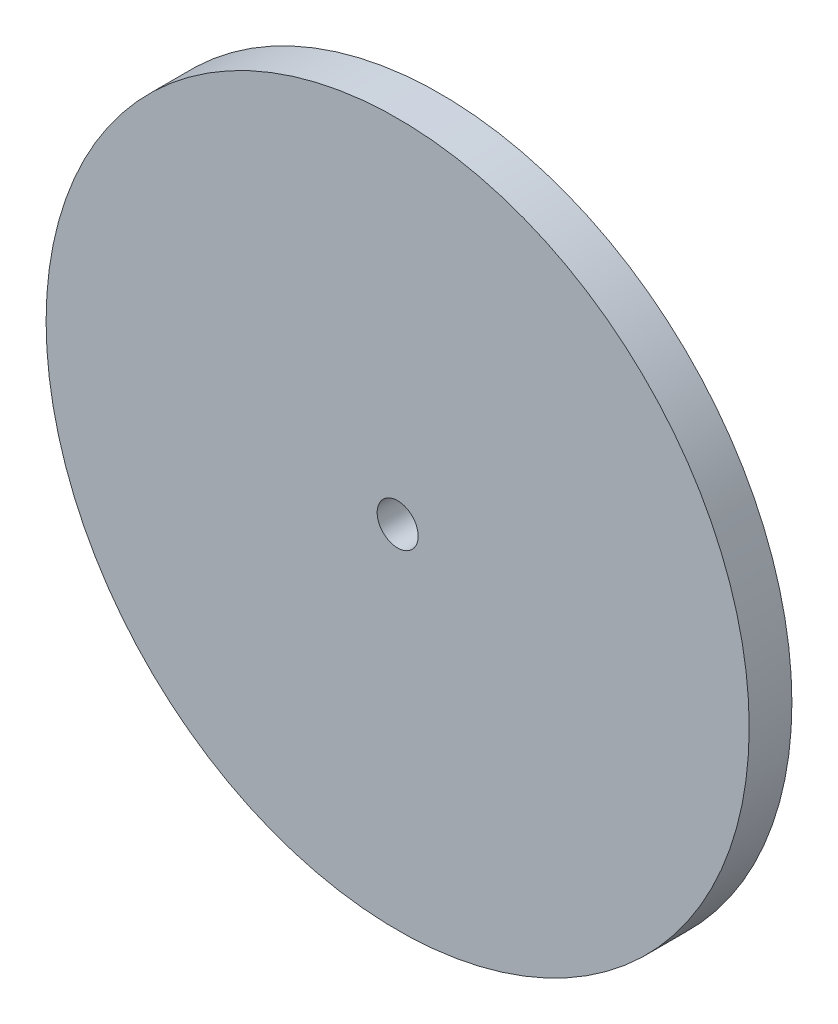
ISO-10303-21;
HEADER;
FILE_DESCRIPTION(('STEP AP214'),'2;1');
FILE_NAME('part.step','',(''),(''),'','','');
FILE_SCHEMA(('AUTOMOTIVE_DESIGN { 1 0 10303 214 1 1 1 1 }'));
ENDSEC;
DATA;
#1=APPLICATION_CONTEXT('core data for automotive mechanical design processes');
#2=APPLICATION_PROTOCOL_DEFINITION('international standard','automotive_design',2000,#1);
#3=PRODUCT_CONTEXT('',#1,'mechanical');
#4=PRODUCT('Part','Part','',(#3));
#5=PRODUCT_RELATED_PRODUCT_CATEGORY('part','',(#4));
#6=PRODUCT_DEFINITION_FORMATION('','',#4);
#7=PRODUCT_DEFINITION_CONTEXT('part definition',#1,'design');
#8=PRODUCT_DEFINITION('design','',#6,#7);
#9=PRODUCT_DEFINITION_SHAPE('','',#8);
#10=(LENGTH_UNIT() NAMED_UNIT(*) SI_UNIT(.MILLI.,.METRE.));
#11=(NAMED_UNIT(*) PLANE_ANGLE_UNIT() SI_UNIT($,.RADIAN.));
#12=(NAMED_UNIT(*) SI_UNIT($,.STERADIAN.) SOLID_ANGLE_UNIT());
#13=UNCERTAINTY_MEASURE_WITH_UNIT(LENGTH_MEASURE(1.E-05),#10,'distance_accuracy_value','');
#14=(GEOMETRIC_REPRESENTATION_CONTEXT(3) GLOBAL_UNCERTAINTY_ASSIGNED_CONTEXT((#13)) GLOBAL_UNIT_ASSIGNED_CONTEXT((#10,
#11,#12)) REPRESENTATION_CONTEXT('',''));
#15=CARTESIAN_POINT('',(0.,0.,0.));
#16=DIRECTION('',(0.,0.,1.));
#17=DIRECTION('',(1.,0.,0.));
#18=AXIS2_PLACEMENT_3D('',#15,#16,#17);
#19=CARTESIAN_POINT('',(0.,0.,5.));
#20=DIRECTION('',(0.,0.,1.));
#21=DIRECTION('',(1.,0.,0.));
#22=AXIS2_PLACEMENT_3D('',#19,#20,#21);
#23=PLANE('',#22);
#24=CARTESIAN_POINT('',(0.,0.,5.));
#25=DIRECTION('',(0.,0.,1.));
#26=DIRECTION('',(1.,0.,0.));
#27=AXIS2_PLACEMENT_3D('',#24,#25,#26);
#28=CIRCLE('',#27,41.1622784622192);
#29=CARTESIAN_POINT('',(41.1622784622192,0.,5.));
#30=VERTEX_POINT('',#29);
#31=EDGE_CURVE('E10',#30,#30,#28,.T.);
#32=ORIENTED_EDGE('',*,*,#31,.T.);
#33=EDGE_LOOP('',(#32));
#34=FACE_BOUND('',#33,.T.);
#35=CARTESIAN_POINT('',(0.,0.,5.));
#36=DIRECTION('',(0.,0.,1.));
#37=DIRECTION('',(1.,0.,0.));
#38=AXIS2_PLACEMENT_3D('',#35,#36,#37);
#39=CIRCLE('',#38,2.4);
#40=CARTESIAN_POINT('',(2.4,0.,5.));
#41=VERTEX_POINT('',#40);
#42=EDGE_CURVE('E41',#41,#41,#39,.T.);
#43=ORIENTED_EDGE('',*,*,#42,.F.);
#44=EDGE_LOOP('',(#43));
#45=FACE_BOUND('',#44,.T.);
#46=ADVANCED_FACE('F30',(#34,#45),#23,.T.);
#47=CARTESIAN_POINT('',(0.,0.,0.));
#48=DIRECTION('',(0.,0.,1.));
#49=DIRECTION('',(1.,0.,0.));
#50=AXIS2_PLACEMENT_3D('',#47,#48,#49);
#51=PLANE('',#50);
#52=CARTESIAN_POINT('',(0.,0.,0.));
#53=DIRECTION('',(0.,0.,1.));
#54=DIRECTION('',(1.,0.,0.));
#55=AXIS2_PLACEMENT_3D('',#52,#53,#54);
#56=CIRCLE('',#55,41.1622784622192);
#57=CARTESIAN_POINT('',(41.1622784622192,0.,0.));
#58=VERTEX_POINT('',#57);
#59=EDGE_CURVE('E34',#58,#58,#56,.T.);
#60=ORIENTED_EDGE('',*,*,#59,.F.);
#61=EDGE_LOOP('',(#60));
#62=FACE_BOUND('',#61,.T.);
#63=CARTESIAN_POINT('',(0.,0.,0.));
#64=DIRECTION('',(0.,0.,1.));
#65=DIRECTION('',(1.,0.,0.));
#66=AXIS2_PLACEMENT_3D('',#63,#64,#65);
#67=CIRCLE('',#66,2.4);
#68=CARTESIAN_POINT('',(2.4,0.,0.));
#69=VERTEX_POINT('',#68);
#70=EDGE_CURVE('E43',#69,#69,#67,.T.);
#71=ORIENTED_EDGE('',*,*,#70,.T.);
#72=EDGE_LOOP('',(#71));
#73=FACE_BOUND('',#72,.T.);
#74=ADVANCED_FACE('F53',(#62,#73),#51,.F.);
#75=CARTESIAN_POINT('',(0.,0.,5.));
#76=DIRECTION('',(0.,0.,-1.));
#77=DIRECTION('',(-1.,0.,0.));
#78=AXIS2_PLACEMENT_3D('',#75,#76,#77);
#79=CYLINDRICAL_SURFACE('',#78,41.1622784622192);
#80=ORIENTED_EDGE('',*,*,#31,.F.);
#81=EDGE_LOOP('',(#80));
#82=FACE_BOUND('',#81,.T.);
#83=ORIENTED_EDGE('',*,*,#59,.T.);
#84=EDGE_LOOP('',(#83));
#85=FACE_BOUND('',#84,.T.);
#86=ADVANCED_FACE('F32',(#82,#85),#79,.T.);
#87=CARTESIAN_POINT('',(0.,0.,5.));
#88=DIRECTION('',(0.,0.,-1.));
#89=DIRECTION('',(-1.,0.,0.));
#90=AXIS2_PLACEMENT_3D('',#87,#88,#89);
#91=CYLINDRICAL_SURFACE('',#90,2.4);
#92=ORIENTED_EDGE('',*,*,#42,.T.);
#93=EDGE_LOOP('',(#92));
#94=FACE_BOUND('',#93,.T.);
#95=ORIENTED_EDGE('',*,*,#70,.F.);
#96=EDGE_LOOP('',(#95));
#97=FACE_BOUND('',#96,.T.);
#98=ADVANCED_FACE('F49',(#94,#97),#91,.F.);
#99=CLOSED_SHELL('',(#46,#74,#86,#98));
#100=MANIFOLD_SOLID_BREP('B2',#99);
#101=ADVANCED_BREP_SHAPE_REPRESENTATION('',(#18,#100),#14);
#102=SHAPE_DEFINITION_REPRESENTATION(#9,#101);
ENDSEC;
END-ISO-10303-21;
